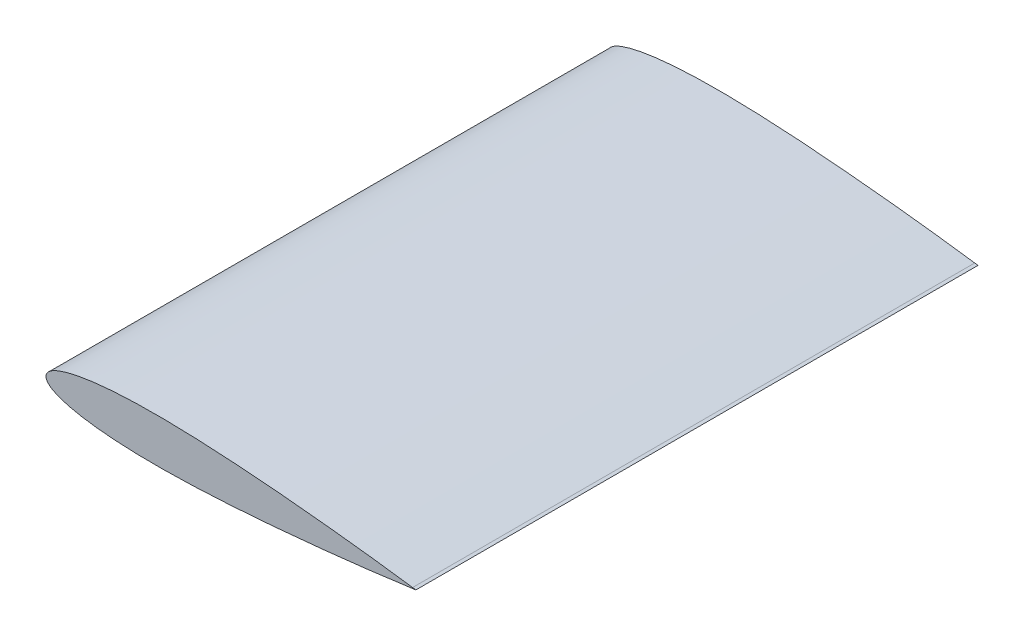
ISO-10303-21;
HEADER;
FILE_DESCRIPTION(('STEP AP214'),'2;1');
FILE_NAME('part.step','',(''),(''),'','','');
FILE_SCHEMA(('AUTOMOTIVE_DESIGN { 1 0 10303 214 1 1 1 1 }'));
ENDSEC;
DATA;
#1=APPLICATION_CONTEXT('core data for automotive mechanical design processes');
#2=APPLICATION_PROTOCOL_DEFINITION('international standard','automotive_design',2000,#1);
#3=PRODUCT_CONTEXT('',#1,'mechanical');
#4=PRODUCT('Part','Part','',(#3));
#5=PRODUCT_RELATED_PRODUCT_CATEGORY('part','',(#4));
#6=PRODUCT_DEFINITION_FORMATION('','',#4);
#7=PRODUCT_DEFINITION_CONTEXT('part definition',#1,'design');
#8=PRODUCT_DEFINITION('design','',#6,#7);
#9=PRODUCT_DEFINITION_SHAPE('','',#8);
#10=(LENGTH_UNIT() NAMED_UNIT(*) SI_UNIT(.MILLI.,.METRE.));
#11=(NAMED_UNIT(*) PLANE_ANGLE_UNIT() SI_UNIT($,.RADIAN.));
#12=(NAMED_UNIT(*) SI_UNIT($,.STERADIAN.) SOLID_ANGLE_UNIT());
#13=UNCERTAINTY_MEASURE_WITH_UNIT(LENGTH_MEASURE(1.E-05),#10,'distance_accuracy_value','');
#14=(GEOMETRIC_REPRESENTATION_CONTEXT(3) GLOBAL_UNCERTAINTY_ASSIGNED_CONTEXT((#13)) GLOBAL_UNIT_ASSIGNED_CONTEXT((#10,
#11,#12)) REPRESENTATION_CONTEXT('',''));
#15=CARTESIAN_POINT('',(0.,0.,0.));
#16=DIRECTION('',(0.,0.,1.));
#17=DIRECTION('',(1.,0.,0.));
#18=AXIS2_PLACEMENT_3D('',#15,#16,#17);
#19=CARTESIAN_POINT('',(150.,0.189,115.));
#20=CARTESIAN_POINT('',(149.970805096912,0.193095691260715,115.));
#21=CARTESIAN_POINT('',(149.8540982582,0.209468247043242,115.));
#22=CARTESIAN_POINT('',(149.591763348968,0.246194704469597,115.));
#23=CARTESIAN_POINT('',(149.155222792969,0.307178536079821,115.));
#24=CARTESIAN_POINT('',(148.545492513342,0.3919555699068,115.));
#25=CARTESIAN_POINT('',(147.76399730052,0.500005904321144,115.));
#26=CARTESIAN_POINT('',(146.812564375925,0.630620596351832,115.));
#27=CARTESIAN_POINT('',(145.69341070453,0.782990201073689,115.));
#28=CARTESIAN_POINT('',(144.409151467845,0.956135402766575,115.));
#29=CARTESIAN_POINT('',(142.96278678987,1.14903559905451,115.));
#30=CARTESIAN_POINT('',(141.35769178054,1.36047715494548,115.));
#31=CARTESIAN_POINT('',(139.597619336599,1.5893242842988,115.));
#32=CARTESIAN_POINT('',(137.686668601895,1.83417085229179,115.));
#33=CARTESIAN_POINT('',(135.629312335385,2.09376129424309,115.));
#34=CARTESIAN_POINT('',(133.430351174265,2.36664253219037,115.));
#35=CARTESIAN_POINT('',(131.094926883966,2.65143914237584,115.));
#36=CARTESIAN_POINT('',(128.628484118311,2.94665817262419,115.));
#37=CARTESIAN_POINT('',(126.036790348204,3.25084502670654,115.));
#38=CARTESIAN_POINT('',(123.325898879011,3.56250519033636,115.));
#39=CARTESIAN_POINT('',(120.502146425195,3.8801893581309,115.));
#40=CARTESIAN_POINT('',(117.572116771939,4.20228327164877,115.));
#41=CARTESIAN_POINT('',(113.473476188158,4.64206643592651,115.));
#42=CARTESIAN_POINT('',(109.256000085758,5.07708862018312,115.));
#43=CARTESIAN_POINT('',(104.929525823092,5.50443477210503,115.));
#44=CARTESIAN_POINT('',(101.575177436803,5.8253632269012,115.));
#45=CARTESIAN_POINT('',(98.1587668558346,6.14116736992054,115.));
#46=CARTESIAN_POINT('',(94.6882647531738,6.45007498087583,115.));
#47=CARTESIAN_POINT('',(91.1717866030756,6.75030975355049,115.));
#48=CARTESIAN_POINT('',(87.6175321743227,7.0400520143276,115.));
#49=CARTESIAN_POINT('',(84.0338081869182,7.31740905368974,115.));
#50=CARTESIAN_POINT('',(80.4289820387045,7.58052493883185,115.));
#51=CARTESIAN_POINT('',(76.8114739900275,7.82742741426382,115.));
#52=CARTESIAN_POINT('',(73.1897283259197,8.0561779381536,115.));
#53=CARTESIAN_POINT('',(69.5722031491566,8.26483141913166,115.));
#54=CARTESIAN_POINT('',(65.967345764473,8.45144941770068,115.));
#55=CARTESIAN_POINT('',(62.3835695520331,8.61415188035927,115.));
#56=CARTESIAN_POINT('',(58.8292413899274,8.75109210099935,115.));
#57=CARTESIAN_POINT('',(55.3126634717548,8.86050829074127,115.));
#58=CARTESIAN_POINT('',(51.8420493348907,8.94080233550501,115.));
#59=CARTESIAN_POINT('',(48.4254954975525,8.99044793145817,115.));
#60=CARTESIAN_POINT('',(45.0709795038643,9.00809988224785,115.));
#61=CARTESIAN_POINT('',(41.7863338935502,8.99260384737877,115.));
#62=CARTESIAN_POINT('',(38.5792302754612,8.94303320425122,115.));
#63=CARTESIAN_POINT('',(35.4571510922466,8.8586205831539,115.));
#64=CARTESIAN_POINT('',(32.4273823796521,8.73890471964187,115.));
#65=CARTESIAN_POINT('',(29.4969979025716,8.58366181469983,115.));
#66=CARTESIAN_POINT('',(26.6728397301915,8.39285718287044,115.));
#67=CARTESIAN_POINT('',(23.9614870454035,8.16681117832529,115.));
#68=CARTESIAN_POINT('',(21.3692576037459,7.90604667827808,115.));
#69=CARTESIAN_POINT('',(18.9021959554581,7.61128925734605,115.));
#70=CARTESIAN_POINT('',(16.5660356103385,7.28359178988453,115.));
#71=CARTESIAN_POINT('',(14.3662103403519,6.92406056488965,115.));
#72=CARTESIAN_POINT('',(12.3077972541546,6.53417109139951,115.));
#73=CARTESIAN_POINT('',(10.3955548227355,6.11534194112809,115.));
#74=CARTESIAN_POINT('',(8.63383459587471,5.66929366393848,115.));
#75=CARTESIAN_POINT('',(7.02663557568259,5.19764554079853,115.));
#76=CARTESIAN_POINT('',(5.5774949250124,4.70217451102286,115.));
#77=CARTESIAN_POINT('',(4.28950564345673,4.18454050488374,115.));
#78=CARTESIAN_POINT('',(3.16522294901504,3.64628426894145,115.));
#79=CARTESIAN_POINT('',(2.20664021687218,3.08862591535891,115.));
#80=CARTESIAN_POINT('',(1.41516034301098,2.51219904900806,115.));
#81=CARTESIAN_POINT('',(0.791935763493216,1.91645291848446,115.));
#82=CARTESIAN_POINT('',(0.338982960610129,1.29929501878373,115.));
#83=CARTESIAN_POINT('',(0.0618004042837896,0.65804672797639,115.));
#84=CARTESIAN_POINT('',(-0.0301259862152015,0.,115.));
#85=CARTESIAN_POINT('',(0.0618004042837998,-0.658046727976442,115.));
#86=CARTESIAN_POINT('',(0.338982960610123,-1.29929501878371,115.));
#87=CARTESIAN_POINT('',(0.791935763493216,-1.91645291848446,115.));
#88=CARTESIAN_POINT('',(1.41516034301099,-2.51219904900806,115.));
#89=CARTESIAN_POINT('',(2.20664021687216,-3.0886259153589,115.));
#90=CARTESIAN_POINT('',(3.16522294901504,-3.64628426894145,115.));
#91=CARTESIAN_POINT('',(4.28950564345674,-4.18454050488375,115.));
#92=CARTESIAN_POINT('',(5.57749492501239,-4.70217451102286,115.));
#93=CARTESIAN_POINT('',(7.0266355756826,-5.19764554079853,115.));
#94=CARTESIAN_POINT('',(8.63383459587468,-5.66929366393848,115.));
#95=CARTESIAN_POINT('',(10.3955548227355,-6.11534194112809,115.));
#96=CARTESIAN_POINT('',(12.3077972541546,-6.53417109139951,115.));
#97=CARTESIAN_POINT('',(14.3662103403519,-6.92406056488966,115.));
#98=CARTESIAN_POINT('',(16.5660356103385,-7.28359178988452,115.));
#99=CARTESIAN_POINT('',(18.9021959554581,-7.61128925734606,115.));
#100=CARTESIAN_POINT('',(21.3692576037459,-7.90604667827808,115.));
#101=CARTESIAN_POINT('',(23.9614870454035,-8.16681117832529,115.));
#102=CARTESIAN_POINT('',(26.6728397301915,-8.39285718287044,115.));
#103=CARTESIAN_POINT('',(29.4969979025716,-8.58366181469983,115.));
#104=CARTESIAN_POINT('',(32.4273823796521,-8.73890471964187,115.));
#105=CARTESIAN_POINT('',(35.4571510922466,-8.8586205831539,115.));
#106=CARTESIAN_POINT('',(38.5792302754613,-8.94303320425122,115.));
#107=CARTESIAN_POINT('',(41.7863338935502,-8.99260384737877,115.));
#108=CARTESIAN_POINT('',(45.0709795038643,-9.00809988224785,115.));
#109=CARTESIAN_POINT('',(48.4254954975525,-8.99044793145816,115.));
#110=CARTESIAN_POINT('',(51.8420493348907,-8.94080233550501,115.));
#111=CARTESIAN_POINT('',(55.3126634717548,-8.86050829074126,115.));
#112=CARTESIAN_POINT('',(58.8292413899273,-8.75109210099935,115.));
#113=CARTESIAN_POINT('',(62.3835695520332,-8.61415188035926,115.));
#114=CARTESIAN_POINT('',(65.967345764473,-8.45144941770068,115.));
#115=CARTESIAN_POINT('',(69.5722031491566,-8.26483141913166,115.));
#116=CARTESIAN_POINT('',(73.1897283259196,-8.0561779381536,115.));
#117=CARTESIAN_POINT('',(76.8114739900275,-7.82742741426383,115.));
#118=CARTESIAN_POINT('',(80.4289820387044,-7.58052493883185,115.));
#119=CARTESIAN_POINT('',(84.0338081869183,-7.31740905368973,115.));
#120=CARTESIAN_POINT('',(87.6175321743227,-7.0400520143276,115.));
#121=CARTESIAN_POINT('',(91.1717866030757,-6.75030975355049,115.));
#122=CARTESIAN_POINT('',(94.6882647531738,-6.45007498087583,115.));
#123=CARTESIAN_POINT('',(98.1587668558347,-6.14116736992054,115.));
#124=CARTESIAN_POINT('',(102.671510988844,-5.72402099368295,115.));
#125=CARTESIAN_POINT('',(108.137829774403,-5.19242718495487,115.));
#126=CARTESIAN_POINT('',(113.473476188158,-4.6420664359265,115.));
#127=CARTESIAN_POINT('',(117.572116771939,-4.20228327164877,115.));
#128=CARTESIAN_POINT('',(120.502146425195,-3.8801893581309,115.));
#129=CARTESIAN_POINT('',(123.325898879011,-3.56250519033636,115.));
#130=CARTESIAN_POINT('',(126.036790348204,-3.25084502670655,115.));
#131=CARTESIAN_POINT('',(128.628484118311,-2.94665817262419,115.));
#132=CARTESIAN_POINT('',(131.094926883965,-2.65143914237584,115.));
#133=CARTESIAN_POINT('',(133.430351174265,-2.36664253219037,115.));
#134=CARTESIAN_POINT('',(135.629312335385,-2.09376129424309,115.));
#135=CARTESIAN_POINT('',(137.686668601895,-1.83417085229178,115.));
#136=CARTESIAN_POINT('',(139.597619336599,-1.5893242842988,115.));
#137=CARTESIAN_POINT('',(141.35769178054,-1.36047715494548,115.));
#138=CARTESIAN_POINT('',(142.96278678987,-1.1490355990545,115.));
#139=CARTESIAN_POINT('',(144.409151467845,-0.956135402766576,115.));
#140=CARTESIAN_POINT('',(145.69341070453,-0.78299020107369,115.));
#141=CARTESIAN_POINT('',(146.812564375925,-0.630620596351834,115.));
#142=CARTESIAN_POINT('',(147.76399730052,-0.500005904321139,115.));
#143=CARTESIAN_POINT('',(148.545492513342,-0.391955569906805,115.));
#144=CARTESIAN_POINT('',(149.155222792969,-0.307178536079818,115.));
#145=CARTESIAN_POINT('',(149.591763348968,-0.246194704469599,115.));
#146=CARTESIAN_POINT('',(149.8540982582,-0.209468247043241,115.));
#147=CARTESIAN_POINT('',(149.970805096912,-0.193095691260715,115.));
#148=CARTESIAN_POINT('',(150.,-0.189,115.));
#149=B_SPLINE_CURVE_WITH_KNOTS('',3,(#19,#20,#21,#22,#23,#24,#25,#26,#27,#28,#29,#30,#31,#32,
#33,#34,#35,#36,#37,#38,#39,#40,#41,#42,#43,#44,#45,#46,#47,#48,#49,#50,#51,#52,#53,#54,#55,#56,
#57,#58,#59,#60,#61,#62,#63,#64,#65,#66,#67,#68,#69,#70,#71,#72,#73,#74,#75,#76,#77,#78,#79,#80,
#81,#82,#83,#84,#85,#86,#87,#88,#89,#90,#91,#92,#93,#94,#95,#96,#97,#98,#99,#100,#101,#102,#103,
#104,#105,#106,#107,#108,#109,#110,#111,#112,#113,#114,#115,#116,#117,#118,#119,#120,#121,#122,
#123,#124,#125,#126,#127,#128,#129,#130,#131,#132,#133,#134,#135,#136,#137,#138,#139,#140,#141,
#142,#143,#144,#145,#146,#147,#148),.UNSPECIFIED.,.F.,.F.,(4,1,1,1,1,1,1,1,1,1,1,1,1,1,1,1,1,1,
1,1,1,1,1,1,1,1,1,1,1,1,1,1,1,1,1,1,1,1,1,1,1,1,1,1,1,1,1,1,1,1,1,1,1,1,1,1,1,1,1,1,1,1,1,1,1,1,
1,1,1,1,1,1,1,1,1,1,1,1,1,1,1,1,1,1,1,1,1,1,1,1,1,1,1,1,1,1,1,1,1,1,1,1,1,1,1,1,1,1,1,1,1,1,1,1,
1,1,1,1,1,1,1,1,1,1,1,1,1,4),(0.,0.000289146012207963,0.00115586329945764,0.00259805874790931,
0.00461228876571111,0.00719359297339866,0.0103358351467946,0.0140314129150332,0.018271453485421,
0.0230457375913408,0.0283428821695204,0.0341501370920946,0.0404537305224403,0.0472385925337366,
0.0544885550062152,0.0621864377849775,0.0703139762203531,0.0788519427142011,0.0877800920894454,
0.0970773621435759,0.106721846803723,0.116690748252035,0.137507310724012,0.14830591335894,
0.159331010090231,0.170556758010199,0.181956676151837,0.193504010213206,0.205171586378334,
0.216932159347369,0.22875798652107,0.240621460081089,0.252494885661238,0.26435049076449,
0.276160731135953,0.287898257272151,0.299535924833916,0.311046958730048,0.322405016007326,
0.33358424112908,0.34455942720365,0.355305876694046,0.365799652157998,0.376017632735469,
0.385937515259467,0.395537820767709,0.404798053904225,0.413698796542159,0.422221689314506,
0.430349461124564,0.4380661515799,0.445357166330782,0.452209423283855,0.458611485415413,
0.464554009305642,0.47002993753563,0.475035084210348,0.479569178588025,0.483636915774579,
0.487250221980046,0.490431492848229,0.493218846943702,0.495674070493982,0.497891229124202,0.5,
0.502108770875799,0.504325929506018,0.506781153056299,0.509568507151771,0.512749778019954,
0.516363084225421,0.520430821411975,0.524964915789652,0.529970062464371,0.535445990694359,
0.541388514584588,0.547790576716145,0.554642833669219,0.561933848420101,0.569650538875436,
0.577778310685494,0.586301203457841,0.595201946095775,0.604462179232291,0.614062484740534,
0.623982367264532,0.634200347842002,0.644694123305954,0.655440572796351,0.66641575887092,
0.677594983992675,0.688953041269952,0.700464075166085,0.712101742727849,0.723839268864047,
0.73564950923551,0.747505114338762,0.759378539918912,0.771242013478931,0.783067840652631,
0.794828413621666,0.806495989786794,0.818043323848163,0.829443241989801,0.840668989909769,
0.862492689275988,0.883309251747965,0.893278153196278,0.902922637856424,0.912219907910555,
0.921148057285799,0.929686023779647,0.937813562215023,0.945511444993785,0.952761407466263,
0.95954626947756,0.965849862907906,0.97165711783048,0.976954262408659,0.981728546514579,
0.985968587084967,0.989664164853205,0.992806407026601,0.995387711234289,0.997401941252091,
0.998844136700542,0.999710853987792,1.),.UNSPECIFIED.);
#150=DIRECTION('',(0.,0.,-1.));
#151=VECTOR('',#150,1.);
#152=SURFACE_OF_LINEAR_EXTRUSION('',#149,#151);
#153=CARTESIAN_POINT('',(150.,0.189,-115.));
#154=CARTESIAN_POINT('',(149.970805096912,0.193095691260715,-115.));
#155=CARTESIAN_POINT('',(149.8540982582,0.209468247043242,-115.));
#156=CARTESIAN_POINT('',(149.591763348968,0.246194704469597,-115.));
#157=CARTESIAN_POINT('',(149.155222792969,0.307178536079821,-115.));
#158=CARTESIAN_POINT('',(148.545492513342,0.3919555699068,-115.));
#159=CARTESIAN_POINT('',(147.76399730052,0.500005904321144,-115.));
#160=CARTESIAN_POINT('',(146.812564375925,0.630620596351832,-115.));
#161=CARTESIAN_POINT('',(145.69341070453,0.782990201073689,-115.));
#162=CARTESIAN_POINT('',(144.409151467845,0.956135402766575,-115.));
#163=CARTESIAN_POINT('',(142.96278678987,1.14903559905451,-115.));
#164=CARTESIAN_POINT('',(141.35769178054,1.36047715494548,-115.));
#165=CARTESIAN_POINT('',(139.597619336599,1.5893242842988,-115.));
#166=CARTESIAN_POINT('',(137.686668601895,1.83417085229179,-115.));
#167=CARTESIAN_POINT('',(135.629312335385,2.09376129424309,-115.));
#168=CARTESIAN_POINT('',(133.430351174265,2.36664253219037,-115.));
#169=CARTESIAN_POINT('',(131.094926883966,2.65143914237584,-115.));
#170=CARTESIAN_POINT('',(128.628484118311,2.94665817262419,-115.));
#171=CARTESIAN_POINT('',(126.036790348204,3.25084502670654,-115.));
#172=CARTESIAN_POINT('',(123.325898879011,3.56250519033636,-115.));
#173=CARTESIAN_POINT('',(120.502146425195,3.8801893581309,-115.));
#174=CARTESIAN_POINT('',(117.572116771939,4.20228327164877,-115.));
#175=CARTESIAN_POINT('',(113.473476188158,4.64206643592651,-115.));
#176=CARTESIAN_POINT('',(109.256000085758,5.07708862018312,-115.));
#177=CARTESIAN_POINT('',(104.929525823092,5.50443477210503,-115.));
#178=CARTESIAN_POINT('',(101.575177436803,5.8253632269012,-115.));
#179=CARTESIAN_POINT('',(98.1587668558346,6.14116736992054,-115.));
#180=CARTESIAN_POINT('',(94.6882647531738,6.45007498087583,-115.));
#181=CARTESIAN_POINT('',(91.1717866030756,6.75030975355049,-115.));
#182=CARTESIAN_POINT('',(87.6175321743227,7.0400520143276,-115.));
#183=CARTESIAN_POINT('',(84.0338081869182,7.31740905368974,-115.));
#184=CARTESIAN_POINT('',(80.4289820387045,7.58052493883185,-115.));
#185=CARTESIAN_POINT('',(76.8114739900275,7.82742741426382,-115.));
#186=CARTESIAN_POINT('',(73.1897283259197,8.0561779381536,-115.));
#187=CARTESIAN_POINT('',(69.5722031491566,8.26483141913166,-115.));
#188=CARTESIAN_POINT('',(65.967345764473,8.45144941770068,-115.));
#189=CARTESIAN_POINT('',(62.3835695520331,8.61415188035927,-115.));
#190=CARTESIAN_POINT('',(58.8292413899274,8.75109210099935,-115.));
#191=CARTESIAN_POINT('',(55.3126634717548,8.86050829074127,-115.));
#192=CARTESIAN_POINT('',(51.8420493348907,8.94080233550501,-115.));
#193=CARTESIAN_POINT('',(48.4254954975525,8.99044793145817,-115.));
#194=CARTESIAN_POINT('',(45.0709795038643,9.00809988224785,-115.));
#195=CARTESIAN_POINT('',(41.7863338935502,8.99260384737877,-115.));
#196=CARTESIAN_POINT('',(38.5792302754612,8.94303320425122,-115.));
#197=CARTESIAN_POINT('',(35.4571510922466,8.8586205831539,-115.));
#198=CARTESIAN_POINT('',(32.4273823796521,8.73890471964187,-115.));
#199=CARTESIAN_POINT('',(29.4969979025716,8.58366181469983,-115.));
#200=CARTESIAN_POINT('',(26.6728397301915,8.39285718287044,-115.));
#201=CARTESIAN_POINT('',(23.9614870454035,8.16681117832529,-115.));
#202=CARTESIAN_POINT('',(21.3692576037459,7.90604667827808,-115.));
#203=CARTESIAN_POINT('',(18.9021959554581,7.61128925734605,-115.));
#204=CARTESIAN_POINT('',(16.5660356103385,7.28359178988453,-115.));
#205=CARTESIAN_POINT('',(14.3662103403519,6.92406056488965,-115.));
#206=CARTESIAN_POINT('',(12.3077972541546,6.53417109139951,-115.));
#207=CARTESIAN_POINT('',(10.3955548227355,6.11534194112809,-115.));
#208=CARTESIAN_POINT('',(8.63383459587471,5.66929366393848,-115.));
#209=CARTESIAN_POINT('',(7.02663557568259,5.19764554079853,-115.));
#210=CARTESIAN_POINT('',(5.5774949250124,4.70217451102286,-115.));
#211=CARTESIAN_POINT('',(4.28950564345673,4.18454050488374,-115.));
#212=CARTESIAN_POINT('',(3.16522294901504,3.64628426894145,-115.));
#213=CARTESIAN_POINT('',(2.20664021687218,3.08862591535891,-115.));
#214=CARTESIAN_POINT('',(1.41516034301098,2.51219904900806,-115.));
#215=CARTESIAN_POINT('',(0.791935763493216,1.91645291848446,-115.));
#216=CARTESIAN_POINT('',(0.338982960610129,1.29929501878373,-115.));
#217=CARTESIAN_POINT('',(0.0618004042837896,0.65804672797639,-115.));
#218=CARTESIAN_POINT('',(-0.0301259862152015,0.,-115.));
#219=CARTESIAN_POINT('',(0.0618004042837998,-0.658046727976442,-115.));
#220=CARTESIAN_POINT('',(0.338982960610123,-1.29929501878371,-115.));
#221=CARTESIAN_POINT('',(0.791935763493216,-1.91645291848446,-115.));
#222=CARTESIAN_POINT('',(1.41516034301099,-2.51219904900806,-115.));
#223=CARTESIAN_POINT('',(2.20664021687216,-3.0886259153589,-115.));
#224=CARTESIAN_POINT('',(3.16522294901504,-3.64628426894145,-115.));
#225=CARTESIAN_POINT('',(4.28950564345674,-4.18454050488375,-115.));
#226=CARTESIAN_POINT('',(5.57749492501239,-4.70217451102286,-115.));
#227=CARTESIAN_POINT('',(7.0266355756826,-5.19764554079853,-115.));
#228=CARTESIAN_POINT('',(8.63383459587468,-5.66929366393848,-115.));
#229=CARTESIAN_POINT('',(10.3955548227355,-6.11534194112809,-115.));
#230=CARTESIAN_POINT('',(12.3077972541546,-6.53417109139951,-115.));
#231=CARTESIAN_POINT('',(14.3662103403519,-6.92406056488966,-115.));
#232=CARTESIAN_POINT('',(16.5660356103385,-7.28359178988452,-115.));
#233=CARTESIAN_POINT('',(18.9021959554581,-7.61128925734606,-115.));
#234=CARTESIAN_POINT('',(21.3692576037459,-7.90604667827808,-115.));
#235=CARTESIAN_POINT('',(23.9614870454035,-8.16681117832529,-115.));
#236=CARTESIAN_POINT('',(26.6728397301915,-8.39285718287044,-115.));
#237=CARTESIAN_POINT('',(29.4969979025716,-8.58366181469983,-115.));
#238=CARTESIAN_POINT('',(32.4273823796521,-8.73890471964187,-115.));
#239=CARTESIAN_POINT('',(35.4571510922466,-8.8586205831539,-115.));
#240=CARTESIAN_POINT('',(38.5792302754613,-8.94303320425122,-115.));
#241=CARTESIAN_POINT('',(41.7863338935502,-8.99260384737877,-115.));
#242=CARTESIAN_POINT('',(45.0709795038643,-9.00809988224785,-115.));
#243=CARTESIAN_POINT('',(48.4254954975525,-8.99044793145816,-115.));
#244=CARTESIAN_POINT('',(51.8420493348907,-8.94080233550501,-115.));
#245=CARTESIAN_POINT('',(55.3126634717548,-8.86050829074126,-115.));
#246=CARTESIAN_POINT('',(58.8292413899273,-8.75109210099935,-115.));
#247=CARTESIAN_POINT('',(62.3835695520332,-8.61415188035926,-115.));
#248=CARTESIAN_POINT('',(65.967345764473,-8.45144941770068,-115.));
#249=CARTESIAN_POINT('',(69.5722031491566,-8.26483141913166,-115.));
#250=CARTESIAN_POINT('',(73.1897283259196,-8.0561779381536,-115.));
#251=CARTESIAN_POINT('',(76.8114739900275,-7.82742741426383,-115.));
#252=CARTESIAN_POINT('',(80.4289820387044,-7.58052493883185,-115.));
#253=CARTESIAN_POINT('',(84.0338081869183,-7.31740905368973,-115.));
#254=CARTESIAN_POINT('',(87.6175321743227,-7.0400520143276,-115.));
#255=CARTESIAN_POINT('',(91.1717866030757,-6.75030975355049,-115.));
#256=CARTESIAN_POINT('',(94.6882647531738,-6.45007498087583,-115.));
#257=CARTESIAN_POINT('',(98.1587668558347,-6.14116736992054,-115.));
#258=CARTESIAN_POINT('',(102.671510988844,-5.72402099368295,-115.));
#259=CARTESIAN_POINT('',(108.137829774403,-5.19242718495487,-115.));
#260=CARTESIAN_POINT('',(113.473476188158,-4.6420664359265,-115.));
#261=CARTESIAN_POINT('',(117.572116771939,-4.20228327164877,-115.));
#262=CARTESIAN_POINT('',(120.502146425195,-3.8801893581309,-115.));
#263=CARTESIAN_POINT('',(123.325898879011,-3.56250519033636,-115.));
#264=CARTESIAN_POINT('',(126.036790348204,-3.25084502670655,-115.));
#265=CARTESIAN_POINT('',(128.628484118311,-2.94665817262419,-115.));
#266=CARTESIAN_POINT('',(131.094926883965,-2.65143914237584,-115.));
#267=CARTESIAN_POINT('',(133.430351174265,-2.36664253219037,-115.));
#268=CARTESIAN_POINT('',(135.629312335385,-2.09376129424309,-115.));
#269=CARTESIAN_POINT('',(137.686668601895,-1.83417085229178,-115.));
#270=CARTESIAN_POINT('',(139.597619336599,-1.5893242842988,-115.));
#271=CARTESIAN_POINT('',(141.35769178054,-1.36047715494548,-115.));
#272=CARTESIAN_POINT('',(142.96278678987,-1.1490355990545,-115.));
#273=CARTESIAN_POINT('',(144.409151467845,-0.956135402766576,-115.));
#274=CARTESIAN_POINT('',(145.69341070453,-0.78299020107369,-115.));
#275=CARTESIAN_POINT('',(146.812564375925,-0.630620596351834,-115.));
#276=CARTESIAN_POINT('',(147.76399730052,-0.500005904321139,-115.));
#277=CARTESIAN_POINT('',(148.545492513342,-0.391955569906805,-115.));
#278=CARTESIAN_POINT('',(149.155222792969,-0.307178536079818,-115.));
#279=CARTESIAN_POINT('',(149.591763348968,-0.246194704469599,-115.));
#280=CARTESIAN_POINT('',(149.8540982582,-0.209468247043241,-115.));
#281=CARTESIAN_POINT('',(149.970805096912,-0.193095691260715,-115.));
#282=CARTESIAN_POINT('',(150.,-0.189,-115.));
#283=B_SPLINE_CURVE_WITH_KNOTS('',3,(#153,#154,#155,#156,#157,#158,#159,#160,#161,#162,#163,
#164,#165,#166,#167,#168,#169,#170,#171,#172,#173,#174,#175,#176,#177,#178,#179,#180,#181,#182,
#183,#184,#185,#186,#187,#188,#189,#190,#191,#192,#193,#194,#195,#196,#197,#198,#199,#200,#201,
#202,#203,#204,#205,#206,#207,#208,#209,#210,#211,#212,#213,#214,#215,#216,#217,#218,#219,#220,
#221,#222,#223,#224,#225,#226,#227,#228,#229,#230,#231,#232,#233,#234,#235,#236,#237,#238,#239,
#240,#241,#242,#243,#244,#245,#246,#247,#248,#249,#250,#251,#252,#253,#254,#255,#256,#257,#258,
#259,#260,#261,#262,#263,#264,#265,#266,#267,#268,#269,#270,#271,#272,#273,#274,#275,#276,#277,
#278,#279,#280,#281,#282),.UNSPECIFIED.,.F.,.F.,(4,1,1,1,1,1,1,1,1,1,1,1,1,1,1,1,1,1,1,1,1,1,1,
1,1,1,1,1,1,1,1,1,1,1,1,1,1,1,1,1,1,1,1,1,1,1,1,1,1,1,1,1,1,1,1,1,1,1,1,1,1,1,1,1,1,1,1,1,1,1,1,
1,1,1,1,1,1,1,1,1,1,1,1,1,1,1,1,1,1,1,1,1,1,1,1,1,1,1,1,1,1,1,1,1,1,1,1,1,1,1,1,1,1,1,1,1,1,1,1,
1,1,1,1,1,1,1,1,4),(0.,0.000289146012207963,0.00115586329945764,0.00259805874790931,
0.00461228876571111,0.00719359297339866,0.0103358351467946,0.0140314129150332,0.018271453485421,
0.0230457375913408,0.0283428821695204,0.0341501370920946,0.0404537305224403,0.0472385925337366,
0.0544885550062152,0.0621864377849775,0.0703139762203531,0.0788519427142011,0.0877800920894454,
0.0970773621435759,0.106721846803723,0.116690748252035,0.137507310724012,0.14830591335894,
0.159331010090231,0.170556758010199,0.181956676151837,0.193504010213206,0.205171586378334,
0.216932159347369,0.22875798652107,0.240621460081089,0.252494885661238,0.26435049076449,
0.276160731135953,0.287898257272151,0.299535924833916,0.311046958730048,0.322405016007326,
0.33358424112908,0.34455942720365,0.355305876694046,0.365799652157998,0.376017632735469,
0.385937515259467,0.395537820767709,0.404798053904225,0.413698796542159,0.422221689314506,
0.430349461124564,0.4380661515799,0.445357166330782,0.452209423283855,0.458611485415413,
0.464554009305642,0.47002993753563,0.475035084210348,0.479569178588025,0.483636915774579,
0.487250221980046,0.490431492848229,0.493218846943702,0.495674070493982,0.497891229124202,0.5,
0.502108770875799,0.504325929506018,0.506781153056299,0.509568507151771,0.512749778019954,
0.516363084225421,0.520430821411975,0.524964915789652,0.529970062464371,0.535445990694359,
0.541388514584588,0.547790576716145,0.554642833669219,0.561933848420101,0.569650538875436,
0.577778310685494,0.586301203457841,0.595201946095775,0.604462179232291,0.614062484740534,
0.623982367264532,0.634200347842002,0.644694123305954,0.655440572796351,0.66641575887092,
0.677594983992675,0.688953041269952,0.700464075166085,0.712101742727849,0.723839268864047,
0.73564950923551,0.747505114338762,0.759378539918912,0.771242013478931,0.783067840652631,
0.794828413621666,0.806495989786794,0.818043323848163,0.829443241989801,0.840668989909769,
0.862492689275988,0.883309251747965,0.893278153196278,0.902922637856424,0.912219907910555,
0.921148057285799,0.929686023779647,0.937813562215023,0.945511444993785,0.952761407466263,
0.95954626947756,0.965849862907906,0.97165711783048,0.976954262408659,0.981728546514579,
0.985968587084967,0.989664164853205,0.992806407026601,0.995387711234289,0.997401941252091,
0.998844136700542,0.999710853987792,1.),.UNSPECIFIED.);
#284=CARTESIAN_POINT('',(150.,0.189,-115.));
#285=VERTEX_POINT('',#284);
#286=CARTESIAN_POINT('',(150.,-0.189,-115.));
#287=VERTEX_POINT('',#286);
#288=EDGE_CURVE('E92',#285,#287,#283,.T.);
#289=ORIENTED_EDGE('',*,*,#288,.T.);
#290=DIRECTION('',(0.,0.,-1.));
#291=VECTOR('',#290,1.);
#292=CARTESIAN_POINT('',(150.,-0.189,115.));
#293=LINE('',#292,#291);
#294=CARTESIAN_POINT('',(150.,-0.189,115.));
#295=VERTEX_POINT('',#294);
#296=EDGE_CURVE('E11',#295,#287,#293,.T.);
#297=ORIENTED_EDGE('',*,*,#296,.F.);
#298=CARTESIAN_POINT('',(150.,0.189,115.));
#299=VERTEX_POINT('',#298);
#300=EDGE_CURVE('E85',#299,#295,#149,.T.);
#301=ORIENTED_EDGE('',*,*,#300,.F.);
#302=DIRECTION('',(0.,0.,-1.));
#303=VECTOR('',#302,1.);
#304=CARTESIAN_POINT('',(150.,0.189,115.));
#305=LINE('',#304,#303);
#306=EDGE_CURVE('E93',#299,#285,#305,.T.);
#307=ORIENTED_EDGE('',*,*,#306,.T.);
#308=EDGE_LOOP('',(#289,#297,#301,#307));
#309=FACE_BOUND('',#308,.T.);
#310=ADVANCED_FACE('F42',(#309),#152,.F.);
#311=CARTESIAN_POINT('',(150.,-0.189,115.));
#312=DIRECTION('',(-0.138927453634997,0.990302561153154,0.));
#313=DIRECTION('',(-0.990302561153154,-0.138927453634997,0.));
#314=AXIS2_PLACEMENT_3D('',#311,#312,#313);
#315=PLANE('',#314);
#316=DIRECTION('',(0.990302561153154,0.138927453634997,0.));
#317=VECTOR('',#316,1.);
#318=CARTESIAN_POINT('',(150.,-0.189,-115.));
#319=LINE('',#318,#317);
#320=CARTESIAN_POINT('',(151.34722964512,1.37178679873728E-13,-115.));
#321=VERTEX_POINT('',#320);
#322=EDGE_CURVE('E72',#287,#321,#319,.T.);
#323=ORIENTED_EDGE('',*,*,#322,.T.);
#324=DIRECTION('',(0.,0.,-1.));
#325=VECTOR('',#324,1.);
#326=CARTESIAN_POINT('',(151.34722964512,1.37178679873728E-13,115.));
#327=LINE('',#326,#325);
#328=CARTESIAN_POINT('',(151.34722964512,1.37178679873728E-13,115.));
#329=VERTEX_POINT('',#328);
#330=EDGE_CURVE('E52',#329,#321,#327,.T.);
#331=ORIENTED_EDGE('',*,*,#330,.F.);
#332=DIRECTION('',(0.990302561153154,0.138927453634997,0.));
#333=VECTOR('',#332,1.);
#334=CARTESIAN_POINT('',(150.,-0.189,115.));
#335=LINE('',#334,#333);
#336=EDGE_CURVE('E80',#295,#329,#335,.T.);
#337=ORIENTED_EDGE('',*,*,#336,.F.);
#338=ORIENTED_EDGE('',*,*,#296,.T.);
#339=EDGE_LOOP('',(#323,#331,#337,#338));
#340=FACE_BOUND('',#339,.T.);
#341=ADVANCED_FACE('F81',(#340),#315,.F.);
#342=CARTESIAN_POINT('',(150.,0.189,115.));
#343=DIRECTION('',(-0.138927453634799,-0.990302561153181,0.));
#344=DIRECTION('',(0.990302561153182,-0.138927453634799,0.));
#345=AXIS2_PLACEMENT_3D('',#342,#343,#344);
#346=PLANE('',#345);
#347=DIRECTION('',(-0.990302561153181,0.138927453634799,0.));
#348=VECTOR('',#347,1.);
#349=CARTESIAN_POINT('',(150.,0.189,-115.));
#350=LINE('',#349,#348);
#351=EDGE_CURVE('E77',#321,#285,#350,.T.);
#352=ORIENTED_EDGE('',*,*,#351,.T.);
#353=ORIENTED_EDGE('',*,*,#306,.F.);
#354=DIRECTION('',(-0.990302561153181,0.138927453634799,0.));
#355=VECTOR('',#354,1.);
#356=CARTESIAN_POINT('',(150.,0.189,115.));
#357=LINE('',#356,#355);
#358=EDGE_CURVE('E60',#329,#299,#357,.T.);
#359=ORIENTED_EDGE('',*,*,#358,.F.);
#360=ORIENTED_EDGE('',*,*,#330,.T.);
#361=EDGE_LOOP('',(#352,#353,#359,#360));
#362=FACE_BOUND('',#361,.T.);
#363=ADVANCED_FACE('F110',(#362),#346,.F.);
#364=CARTESIAN_POINT('',(0.,0.,115.));
#365=DIRECTION('',(0.,0.,-1.));
#366=DIRECTION('',(-1.,0.,0.));
#367=AXIS2_PLACEMENT_3D('',#364,#365,#366);
#368=PLANE('',#367);
#369=ORIENTED_EDGE('',*,*,#300,.T.);
#370=ORIENTED_EDGE('',*,*,#336,.T.);
#371=ORIENTED_EDGE('',*,*,#358,.T.);
#372=EDGE_LOOP('',(#369,#370,#371));
#373=FACE_BOUND('',#372,.T.);
#374=ADVANCED_FACE('F88',(#373),#368,.F.);
#375=CARTESIAN_POINT('',(0.,0.,-115.));
#376=DIRECTION('',(0.,0.,-1.));
#377=DIRECTION('',(-1.,0.,0.));
#378=AXIS2_PLACEMENT_3D('',#375,#376,#377);
#379=PLANE('',#378);
#380=ORIENTED_EDGE('',*,*,#288,.F.);
#381=ORIENTED_EDGE('',*,*,#351,.F.);
#382=ORIENTED_EDGE('',*,*,#322,.F.);
#383=EDGE_LOOP('',(#380,#381,#382));
#384=FACE_BOUND('',#383,.T.);
#385=ADVANCED_FACE('F111',(#384),#379,.T.);
#386=CLOSED_SHELL('',(#310,#341,#363,#374,#385));
#387=MANIFOLD_SOLID_BREP('B2',#386);
#388=ADVANCED_BREP_SHAPE_REPRESENTATION('',(#18,#387),#14);
#389=SHAPE_DEFINITION_REPRESENTATION(#9,#388);
ENDSEC;
END-ISO-10303-21;
